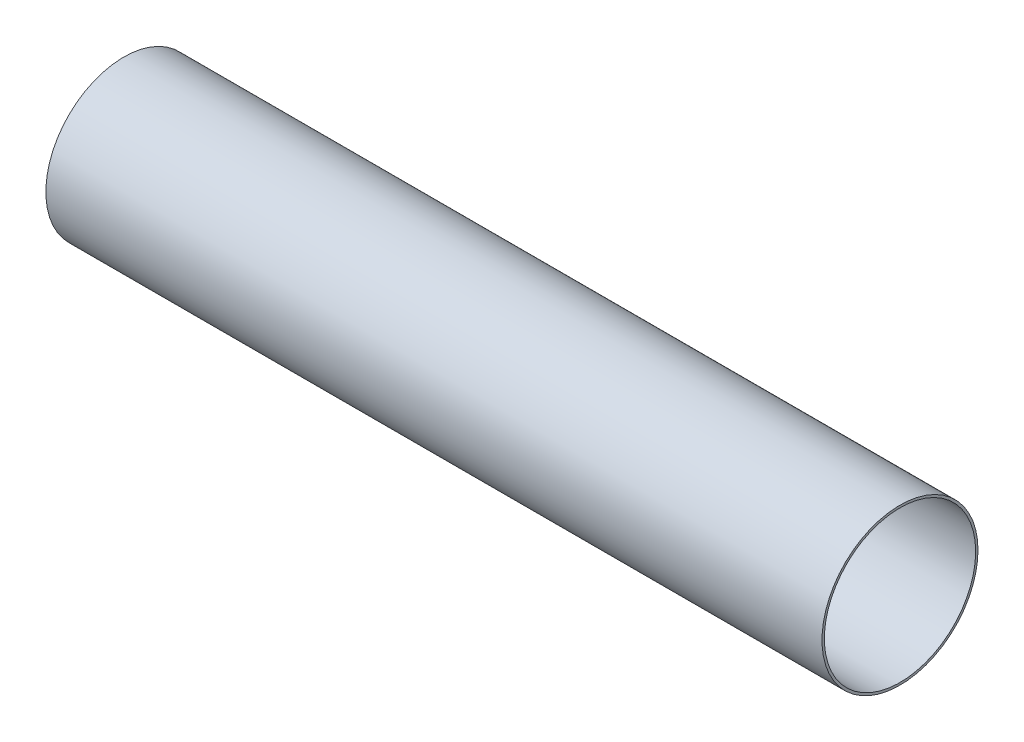
ISO-10303-21;
HEADER;
FILE_DESCRIPTION(('STEP AP214'),'2;1');
FILE_NAME('part.step','',(''),(''),'','','');
FILE_SCHEMA(('AUTOMOTIVE_DESIGN { 1 0 10303 214 1 1 1 1 }'));
ENDSEC;
DATA;
#1=APPLICATION_CONTEXT('core data for automotive mechanical design processes');
#2=APPLICATION_PROTOCOL_DEFINITION('international standard','automotive_design',2000,#1);
#3=PRODUCT_CONTEXT('',#1,'mechanical');
#4=PRODUCT('Part','Part','',(#3));
#5=PRODUCT_RELATED_PRODUCT_CATEGORY('part','',(#4));
#6=PRODUCT_DEFINITION_FORMATION('','',#4);
#7=PRODUCT_DEFINITION_CONTEXT('part definition',#1,'design');
#8=PRODUCT_DEFINITION('design','',#6,#7);
#9=PRODUCT_DEFINITION_SHAPE('','',#8);
#10=(LENGTH_UNIT() NAMED_UNIT(*) SI_UNIT(.MILLI.,.METRE.));
#11=(NAMED_UNIT(*) PLANE_ANGLE_UNIT() SI_UNIT($,.RADIAN.));
#12=(NAMED_UNIT(*) SI_UNIT($,.STERADIAN.) SOLID_ANGLE_UNIT());
#13=UNCERTAINTY_MEASURE_WITH_UNIT(LENGTH_MEASURE(1.E-05),#10,'distance_accuracy_value','');
#14=(GEOMETRIC_REPRESENTATION_CONTEXT(3) GLOBAL_UNCERTAINTY_ASSIGNED_CONTEXT((#13)) GLOBAL_UNIT_ASSIGNED_CONTEXT((#10,
#11,#12)) REPRESENTATION_CONTEXT('',''));
#15=CARTESIAN_POINT('',(0.,0.,0.));
#16=DIRECTION('',(0.,0.,1.));
#17=DIRECTION('',(1.,0.,0.));
#18=AXIS2_PLACEMENT_3D('',#15,#16,#17);
#19=CARTESIAN_POINT('',(508.,0.,0.));
#20=DIRECTION('',(1.,0.,0.));
#21=DIRECTION('',(0.,0.,-1.));
#22=AXIS2_PLACEMENT_3D('',#19,#20,#21);
#23=PLANE('',#22);
#24=CARTESIAN_POINT('',(508.,0.,0.));
#25=DIRECTION('',(1.,0.,0.));
#26=DIRECTION('',(0.,0.,-1.));
#27=AXIS2_PLACEMENT_3D('',#24,#25,#26);
#28=CIRCLE('',#27,51.054);
#29=CARTESIAN_POINT('',(508.,0.,-51.054));
#30=VERTEX_POINT('',#29);
#31=EDGE_CURVE('E10',#30,#30,#28,.T.);
#32=ORIENTED_EDGE('',*,*,#31,.T.);
#33=EDGE_LOOP('',(#32));
#34=FACE_BOUND('',#33,.T.);
#35=CARTESIAN_POINT('',(508.,0.,0.));
#36=DIRECTION('',(1.,0.,0.));
#37=DIRECTION('',(0.,0.,-1.));
#38=AXIS2_PLACEMENT_3D('',#35,#36,#37);
#39=CIRCLE('',#38,49.53);
#40=CARTESIAN_POINT('',(508.,0.,-49.53));
#41=VERTEX_POINT('',#40);
#42=EDGE_CURVE('E50',#41,#41,#39,.T.);
#43=ORIENTED_EDGE('',*,*,#42,.F.);
#44=EDGE_LOOP('',(#43));
#45=FACE_BOUND('',#44,.T.);
#46=ADVANCED_FACE('F39',(#34,#45),#23,.T.);
#47=CARTESIAN_POINT('',(0.,0.,0.));
#48=DIRECTION('',(1.,0.,0.));
#49=DIRECTION('',(0.,0.,-1.));
#50=AXIS2_PLACEMENT_3D('',#47,#48,#49);
#51=PLANE('',#50);
#52=CARTESIAN_POINT('',(0.,0.,0.));
#53=DIRECTION('',(1.,0.,0.));
#54=DIRECTION('',(0.,0.,-1.));
#55=AXIS2_PLACEMENT_3D('',#52,#53,#54);
#56=CIRCLE('',#55,51.054);
#57=CARTESIAN_POINT('',(0.,0.,-51.054));
#58=VERTEX_POINT('',#57);
#59=EDGE_CURVE('E43',#58,#58,#56,.T.);
#60=ORIENTED_EDGE('',*,*,#59,.F.);
#61=EDGE_LOOP('',(#60));
#62=FACE_BOUND('',#61,.T.);
#63=CARTESIAN_POINT('',(0.,0.,0.));
#64=DIRECTION('',(1.,0.,0.));
#65=DIRECTION('',(0.,0.,-1.));
#66=AXIS2_PLACEMENT_3D('',#63,#64,#65);
#67=CIRCLE('',#66,49.53);
#68=CARTESIAN_POINT('',(0.,0.,-49.53));
#69=VERTEX_POINT('',#68);
#70=EDGE_CURVE('E52',#69,#69,#67,.T.);
#71=ORIENTED_EDGE('',*,*,#70,.T.);
#72=EDGE_LOOP('',(#71));
#73=FACE_BOUND('',#72,.T.);
#74=ADVANCED_FACE('F62',(#62,#73),#51,.F.);
#75=CARTESIAN_POINT('',(508.,0.,0.));
#76=DIRECTION('',(-1.,0.,0.));
#77=DIRECTION('',(0.,0.,1.));
#78=AXIS2_PLACEMENT_3D('',#75,#76,#77);
#79=CYLINDRICAL_SURFACE('',#78,51.054);
#80=ORIENTED_EDGE('',*,*,#31,.F.);
#81=EDGE_LOOP('',(#80));
#82=FACE_BOUND('',#81,.T.);
#83=ORIENTED_EDGE('',*,*,#59,.T.);
#84=EDGE_LOOP('',(#83));
#85=FACE_BOUND('',#84,.T.);
#86=ADVANCED_FACE('F41',(#82,#85),#79,.T.);
#87=CARTESIAN_POINT('',(508.,0.,0.));
#88=DIRECTION('',(-1.,0.,0.));
#89=DIRECTION('',(0.,0.,1.));
#90=AXIS2_PLACEMENT_3D('',#87,#88,#89);
#91=CYLINDRICAL_SURFACE('',#90,49.53);
#92=ORIENTED_EDGE('',*,*,#42,.T.);
#93=EDGE_LOOP('',(#92));
#94=FACE_BOUND('',#93,.T.);
#95=ORIENTED_EDGE('',*,*,#70,.F.);
#96=EDGE_LOOP('',(#95));
#97=FACE_BOUND('',#96,.T.);
#98=ADVANCED_FACE('F58',(#94,#97),#91,.F.);
#99=CLOSED_SHELL('',(#46,#74,#86,#98));
#100=MANIFOLD_SOLID_BREP('B2',#99);
#101=ADVANCED_BREP_SHAPE_REPRESENTATION('',(#18,#100),#14);
#102=SHAPE_DEFINITION_REPRESENTATION(#9,#101);
ENDSEC;
END-ISO-10303-21;
